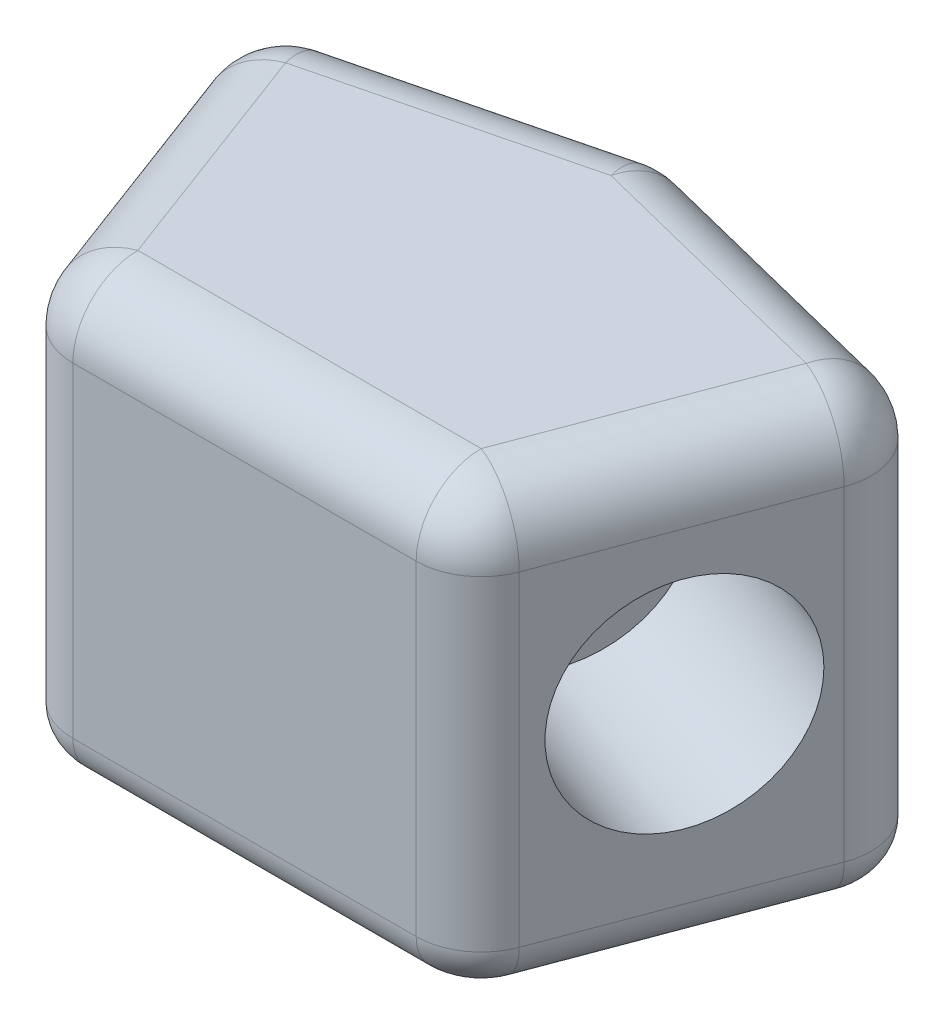
ISO-10303-21;
HEADER;
FILE_DESCRIPTION(('STEP AP214'),'2;1');
FILE_NAME('part.step','',(''),(''),'','','');
FILE_SCHEMA(('AUTOMOTIVE_DESIGN { 1 0 10303 214 1 1 1 1 }'));
ENDSEC;
DATA;
#1=APPLICATION_CONTEXT('core data for automotive mechanical design processes');
#2=APPLICATION_PROTOCOL_DEFINITION('international standard','automotive_design',2000,#1);
#3=PRODUCT_CONTEXT('',#1,'mechanical');
#4=PRODUCT('Part','Part','',(#3));
#5=PRODUCT_RELATED_PRODUCT_CATEGORY('part','',(#4));
#6=PRODUCT_DEFINITION_FORMATION('','',#4);
#7=PRODUCT_DEFINITION_CONTEXT('part definition',#1,'design');
#8=PRODUCT_DEFINITION('design','',#6,#7);
#9=PRODUCT_DEFINITION_SHAPE('','',#8);
#10=(LENGTH_UNIT() NAMED_UNIT(*) SI_UNIT(.MILLI.,.METRE.));
#11=(NAMED_UNIT(*) PLANE_ANGLE_UNIT() SI_UNIT($,.RADIAN.));
#12=(NAMED_UNIT(*) SI_UNIT($,.STERADIAN.) SOLID_ANGLE_UNIT());
#13=UNCERTAINTY_MEASURE_WITH_UNIT(LENGTH_MEASURE(1.E-05),#10,'distance_accuracy_value','');
#14=(GEOMETRIC_REPRESENTATION_CONTEXT(3) GLOBAL_UNCERTAINTY_ASSIGNED_CONTEXT((#13)) GLOBAL_UNIT_ASSIGNED_CONTEXT((#10,
#11,#12)) REPRESENTATION_CONTEXT('',''));
#15=CARTESIAN_POINT('',(0.,0.,0.));
#16=DIRECTION('',(0.,0.,1.));
#17=DIRECTION('',(1.,0.,0.));
#18=AXIS2_PLACEMENT_3D('',#15,#16,#17);
#19=CARTESIAN_POINT('',(-8.,10.,-8.));
#20=DIRECTION('',(0.936329177569045,0.,-0.351123441588392));
#21=DIRECTION('',(-0.351123441588392,0.,-0.936329177569045));
#22=AXIS2_PLACEMENT_3D('',#19,#20,#21);
#23=PLANE('',#22);
#24=CARTESIAN_POINT('',(-6.40449376635357,5.,-3.74531671027618));
#25=DIRECTION('',(-0.936329177569045,0.,0.351123441588392));
#26=DIRECTION('',(0.351123441588392,0.,0.936329177569045));
#27=AXIS2_PLACEMENT_3D('',#24,#25,#26);
#28=CIRCLE('',#27,2.5);
#29=CARTESIAN_POINT('',(-5.52668516238259,5.,-1.40449376635357));
#30=VERTEX_POINT('',#29);
#31=EDGE_CURVE('E773',#30,#30,#28,.T.);
#32=ORIENTED_EDGE('',*,*,#31,.F.);
#33=EDGE_LOOP('',(#32));
#34=FACE_BOUND('',#33,.T.);
#35=DIRECTION('',(0.,-1.,0.));
#36=VECTOR('',#35,1.);
#37=CARTESIAN_POINT('',(-7.40969382957686,10.,-6.42585021220497));
#38=LINE('',#37,#36);
#39=CARTESIAN_POINT('',(-7.40969382957686,8.5,-6.42585021220497));
#40=VERTEX_POINT('',#39);
#41=CARTESIAN_POINT('',(-7.40969382957686,0.999999999999999,-6.42585021220497));
#42=VERTEX_POINT('',#41);
#43=EDGE_CURVE('E342',#40,#42,#38,.T.);
#44=ORIENTED_EDGE('',*,*,#43,.T.);
#45=DIRECTION('',(0.351123441588392,0.,0.936329177569045));
#46=VECTOR('',#45,1.);
#47=CARTESIAN_POINT('',(-5.36499306410653,0.999999999999999,-0.973314837617409));
#48=LINE('',#47,#46);
#49=CARTESIAN_POINT('',(-5.36499306410653,0.999999999999992,-0.973314837617412));
#50=VERTEX_POINT('',#49);
#51=EDGE_CURVE('E279',#42,#50,#48,.T.);
#52=ORIENTED_EDGE('',*,*,#51,.T.);
#53=DIRECTION('',(0.,-1.,0.));
#54=VECTOR('',#53,1.);
#55=CARTESIAN_POINT('',(-5.36499306410653,10.,-0.973314837617412));
#56=LINE('',#55,#54);
#57=CARTESIAN_POINT('',(-5.36499306410653,8.5,-0.973314837617412));
#58=VERTEX_POINT('',#57);
#59=EDGE_CURVE('E335',#50,#58,#56,.F.);
#60=ORIENTED_EDGE('',*,*,#59,.T.);
#61=DIRECTION('',(0.351123441588392,0.,0.936329177569045));
#62=VECTOR('',#61,1.);
#63=CARTESIAN_POINT('',(-8.,8.5,-8.));
#64=LINE('',#63,#62);
#65=EDGE_CURVE('E217',#58,#40,#64,.F.);
#66=ORIENTED_EDGE('',*,*,#65,.T.);
#67=EDGE_LOOP('',(#44,#52,#60,#66));
#68=FACE_BOUND('',#67,.T.);
#69=ADVANCED_FACE('F36',(#34,#68),#23,.F.);
#70=CARTESIAN_POINT('',(-5.,10.,0.));
#71=DIRECTION('',(0.,0.,-1.));
#72=DIRECTION('',(-1.,0.,0.));
#73=AXIS2_PLACEMENT_3D('',#70,#71,#72);
#74=PLANE('',#73);
#75=DIRECTION('',(0.,-1.,0.));
#76=VECTOR('',#75,1.);
#77=CARTESIAN_POINT('',(-3.96049929775296,10.,0.));
#78=LINE('',#77,#76);
#79=CARTESIAN_POINT('',(-3.96049929775296,8.5,0.));
#80=VERTEX_POINT('',#79);
#81=CARTESIAN_POINT('',(-3.96049929775296,0.999999999999999,0.));
#82=VERTEX_POINT('',#81);
#83=EDGE_CURVE('E172',#80,#82,#78,.T.);
#84=ORIENTED_EDGE('',*,*,#83,.T.);
#85=DIRECTION('',(1.,0.,0.));
#86=VECTOR('',#85,1.);
#87=CARTESIAN_POINT('',(3.96049929775296,0.999999999999999,0.));
#88=LINE('',#87,#86);
#89=CARTESIAN_POINT('',(3.96049929775296,0.999999999999999,0.));
#90=VERTEX_POINT('',#89);
#91=EDGE_CURVE('E283',#82,#90,#88,.T.);
#92=ORIENTED_EDGE('',*,*,#91,.T.);
#93=DIRECTION('',(0.,-1.,0.));
#94=VECTOR('',#93,1.);
#95=CARTESIAN_POINT('',(3.96049929775296,10.,0.));
#96=LINE('',#95,#94);
#97=CARTESIAN_POINT('',(3.96049929775296,8.5,0.));
#98=VERTEX_POINT('',#97);
#99=EDGE_CURVE('E345',#90,#98,#96,.F.);
#100=ORIENTED_EDGE('',*,*,#99,.T.);
#101=DIRECTION('',(1.,0.,0.));
#102=VECTOR('',#101,1.);
#103=CARTESIAN_POINT('',(-5.,8.5,0.));
#104=LINE('',#103,#102);
#105=EDGE_CURVE('E212',#98,#80,#104,.F.);
#106=ORIENTED_EDGE('',*,*,#105,.T.);
#107=EDGE_LOOP('',(#84,#92,#100,#106));
#108=FACE_BOUND('',#107,.T.);
#109=ADVANCED_FACE('F351',(#108),#74,.F.);
#110=CARTESIAN_POINT('',(5.,10.,0.));
#111=DIRECTION('',(-0.936329177569045,0.,-0.351123441588392));
#112=DIRECTION('',(-0.351123441588392,0.,0.936329177569045));
#113=AXIS2_PLACEMENT_3D('',#110,#111,#112);
#114=PLANE('',#113);
#115=CARTESIAN_POINT('',(6.40449376635357,5.,-3.74531671027618));
#116=DIRECTION('',(0.936329177569045,0.,0.351123441588391));
#117=DIRECTION('',(0.351123441588392,0.,-0.936329177569045));
#118=AXIS2_PLACEMENT_3D('',#115,#116,#117);
#119=CIRCLE('',#118,2.5);
#120=CARTESIAN_POINT('',(7.28230237032455,5.,-6.08613965419879));
#121=VERTEX_POINT('',#120);
#122=EDGE_CURVE('E766',#121,#121,#119,.T.);
#123=ORIENTED_EDGE('',*,*,#122,.F.);
#124=EDGE_LOOP('',(#123));
#125=FACE_BOUND('',#124,.T.);
#126=DIRECTION('',(0.,-1.,0.));
#127=VECTOR('',#126,1.);
#128=CARTESIAN_POINT('',(5.36499306410653,10.,-0.973314837617413));
#129=LINE('',#128,#127);
#130=CARTESIAN_POINT('',(5.36499306410653,8.5,-0.973314837617413));
#131=VERTEX_POINT('',#130);
#132=CARTESIAN_POINT('',(5.36499306410653,0.999999999999999,-0.973314837617413));
#133=VERTEX_POINT('',#132);
#134=EDGE_CURVE('E171',#131,#133,#129,.T.);
#135=ORIENTED_EDGE('',*,*,#134,.T.);
#136=DIRECTION('',(0.351123441588392,0.,-0.936329177569045));
#137=VECTOR('',#136,1.);
#138=CARTESIAN_POINT('',(7.40969382957686,0.999999999999999,-6.42585021220497));
#139=LINE('',#138,#137);
#140=CARTESIAN_POINT('',(7.40969382957686,0.999999999999999,-6.42585021220497));
#141=VERTEX_POINT('',#140);
#142=EDGE_CURVE('E167',#133,#141,#139,.T.);
#143=ORIENTED_EDGE('',*,*,#142,.T.);
#144=DIRECTION('',(0.,-1.,0.));
#145=VECTOR('',#144,1.);
#146=CARTESIAN_POINT('',(7.40969382957686,10.,-6.42585021220497));
#147=LINE('',#146,#145);
#148=CARTESIAN_POINT('',(7.40969382957686,8.5,-6.42585021220497));
#149=VERTEX_POINT('',#148);
#150=EDGE_CURVE('E159',#141,#149,#147,.F.);
#151=ORIENTED_EDGE('',*,*,#150,.T.);
#152=DIRECTION('',(0.351123441588392,0.,-0.936329177569045));
#153=VECTOR('',#152,1.);
#154=CARTESIAN_POINT('',(5.,8.5,0.));
#155=LINE('',#154,#153);
#156=EDGE_CURVE('E164',#149,#131,#155,.F.);
#157=ORIENTED_EDGE('',*,*,#156,.T.);
#158=EDGE_LOOP('',(#135,#143,#151,#157));
#159=FACE_BOUND('',#158,.T.);
#160=ADVANCED_FACE('F162',(#125,#159),#114,.F.);
#161=CARTESIAN_POINT('',(8.,10.,-8.));
#162=DIRECTION('',(-0.242535625036333,0.,0.970142500145332));
#163=DIRECTION('',(0.970142500145332,0.,0.242535625036333));
#164=AXIS2_PLACEMENT_3D('',#161,#162,#163);
#165=PLANE('',#164);
#166=DIRECTION('',(0.,-1.,0.));
#167=VECTOR('',#166,1.);
#168=CARTESIAN_POINT('',(6.36900350077779,10.,-8.40774912480555));
#169=LINE('',#168,#167);
#170=CARTESIAN_POINT('',(6.36900350077779,8.5,-8.40774912480555));
#171=VERTEX_POINT('',#170);
#172=CARTESIAN_POINT('',(6.36900350077779,0.999999999999999,-8.40774912480555));
#173=VERTEX_POINT('',#172);
#174=EDGE_CURVE('E196',#171,#173,#169,.T.);
#175=ORIENTED_EDGE('',*,*,#174,.T.);
#176=DIRECTION('',(-0.970142500145332,0.,-0.242535625036333));
#177=VECTOR('',#176,1.);
#178=CARTESIAN_POINT('',(0.363803437554493,0.999999999999999,-9.90904914061138));
#179=LINE('',#178,#177);
#180=CARTESIAN_POINT('',(0.363803437554496,0.999999999999999,-9.90904914061138));
#181=VERTEX_POINT('',#180);
#182=EDGE_CURVE('E60',#173,#181,#179,.T.);
#183=ORIENTED_EDGE('',*,*,#182,.T.);
#184=DIRECTION('',(0.,-1.,0.));
#185=VECTOR('',#184,1.);
#186=CARTESIAN_POINT('',(0.363803437554496,10.,-9.90904914061138));
#187=LINE('',#186,#185);
#188=CARTESIAN_POINT('',(0.363803437554496,8.5,-9.90904914061138));
#189=VERTEX_POINT('',#188);
#190=EDGE_CURVE('E332',#181,#189,#187,.F.);
#191=ORIENTED_EDGE('',*,*,#190,.T.);
#192=DIRECTION('',(-0.970142500145332,0.,-0.242535625036333));
#193=VECTOR('',#192,1.);
#194=CARTESIAN_POINT('',(8.,8.5,-8.));
#195=LINE('',#194,#193);
#196=EDGE_CURVE('E227',#189,#171,#195,.F.);
#197=ORIENTED_EDGE('',*,*,#196,.T.);
#198=EDGE_LOOP('',(#175,#183,#191,#197));
#199=FACE_BOUND('',#198,.T.);
#200=ADVANCED_FACE('F330',(#199),#165,.F.);
#201=CARTESIAN_POINT('',(0.,10.,-10.));
#202=DIRECTION('',(0.242535625036333,0.,0.970142500145332));
#203=DIRECTION('',(0.970142500145332,0.,-0.242535625036333));
#204=AXIS2_PLACEMENT_3D('',#201,#202,#203);
#205=PLANE('',#204);
#206=DIRECTION('',(0.,-1.,0.));
#207=VECTOR('',#206,1.);
#208=CARTESIAN_POINT('',(-0.363803437554502,10.,-9.90904914061137));
#209=LINE('',#208,#207);
#210=CARTESIAN_POINT('',(-0.363803437554502,8.5,-9.90904914061137));
#211=VERTEX_POINT('',#210);
#212=CARTESIAN_POINT('',(-0.363803437554502,0.999999999999999,-9.90904914061137));
#213=VERTEX_POINT('',#212);
#214=EDGE_CURVE('E333',#211,#213,#209,.T.);
#215=ORIENTED_EDGE('',*,*,#214,.T.);
#216=DIRECTION('',(-0.970142500145332,0.,0.242535625036333));
#217=VECTOR('',#216,1.);
#218=CARTESIAN_POINT('',(-6.3690035007778,0.999999999999999,-8.40774912480555));
#219=LINE('',#218,#217);
#220=CARTESIAN_POINT('',(-6.36900350077779,0.999999999999999,-8.40774912480555));
#221=VERTEX_POINT('',#220);
#222=EDGE_CURVE('E11',#213,#221,#219,.T.);
#223=ORIENTED_EDGE('',*,*,#222,.T.);
#224=DIRECTION('',(0.,-1.,0.));
#225=VECTOR('',#224,1.);
#226=CARTESIAN_POINT('',(-6.36900350077779,10.,-8.40774912480555));
#227=LINE('',#226,#225);
#228=CARTESIAN_POINT('',(-6.36900350077779,8.5,-8.40774912480555));
#229=VERTEX_POINT('',#228);
#230=EDGE_CURVE('E337',#221,#229,#227,.F.);
#231=ORIENTED_EDGE('',*,*,#230,.T.);
#232=DIRECTION('',(-0.970142500145332,0.,0.242535625036333));
#233=VECTOR('',#232,1.);
#234=CARTESIAN_POINT('',(0.,8.5,-10.));
#235=LINE('',#234,#233);
#236=EDGE_CURVE('E222',#229,#211,#235,.F.);
#237=ORIENTED_EDGE('',*,*,#236,.T.);
#238=EDGE_LOOP('',(#215,#223,#231,#237));
#239=FACE_BOUND('',#238,.T.);
#240=ADVANCED_FACE('F385',(#239),#205,.F.);
#241=CARTESIAN_POINT('',(0.,10.,0.));
#242=DIRECTION('',(0.,-1.,0.));
#243=DIRECTION('',(0.,0.,-1.));
#244=AXIS2_PLACEMENT_3D('',#241,#242,#243);
#245=PLANE('',#244);
#246=DIRECTION('',(1.,0.,0.));
#247=VECTOR('',#246,1.);
#248=CARTESIAN_POINT('',(0.,10.,-1.5));
#249=LINE('',#248,#247);
#250=CARTESIAN_POINT('',(-3.96049929775296,10.,-1.5));
#251=VERTEX_POINT('',#250);
#252=CARTESIAN_POINT('',(3.96049929775296,10.,-1.5));
#253=VERTEX_POINT('',#252);
#254=EDGE_CURVE('E206',#251,#253,#249,.T.);
#255=ORIENTED_EDGE('',*,*,#254,.T.);
#256=DIRECTION('',(0.351123441588392,0.,-0.936329177569045));
#257=VECTOR('',#256,1.);
#258=CARTESIAN_POINT('',(2.97906787748205,10.,1.11715045405577));
#259=LINE('',#258,#257);
#260=CARTESIAN_POINT('',(6.00520006322329,10.,-6.95253537458755));
#261=VERTEX_POINT('',#260);
#262=EDGE_CURVE('E192',#253,#261,#259,.T.);
#263=ORIENTED_EDGE('',*,*,#262,.T.);
#264=DIRECTION('',(-0.970142500145332,0.,-0.242535625036333));
#265=VECTOR('',#264,1.);
#266=CARTESIAN_POINT('',(1.98913773891609,10.,-7.95655095566435));
#267=LINE('',#266,#265);
#268=CARTESIAN_POINT('',(0.,10.,-8.45383539039338));
#269=VERTEX_POINT('',#268);
#270=EDGE_CURVE('E197',#261,#269,#267,.T.);
#271=ORIENTED_EDGE('',*,*,#270,.T.);
#272=DIRECTION('',(-0.970142500145332,0.,0.242535625036333));
#273=VECTOR('',#272,1.);
#274=CARTESIAN_POINT('',(-1.98913773891609,10.,-7.95655095566435));
#275=LINE('',#274,#273);
#276=CARTESIAN_POINT('',(-6.0052000632233,10.,-6.95253537458755));
#277=VERTEX_POINT('',#276);
#278=EDGE_CURVE('E199',#269,#277,#275,.T.);
#279=ORIENTED_EDGE('',*,*,#278,.T.);
#280=DIRECTION('',(0.351123441588392,0.,0.936329177569045));
#281=VECTOR('',#280,1.);
#282=CARTESIAN_POINT('',(-2.97906787748205,10.,1.11715045405577));
#283=LINE('',#282,#281);
#284=EDGE_CURVE('E204',#277,#251,#283,.T.);
#285=ORIENTED_EDGE('',*,*,#284,.T.);
#286=EDGE_LOOP('',(#255,#263,#271,#279,#285));
#287=FACE_BOUND('',#286,.T.);
#288=ADVANCED_FACE('F416',(#287),#245,.F.);
#289=CARTESIAN_POINT('',(0.,0.,0.));
#290=DIRECTION('',(0.,-1.,0.));
#291=DIRECTION('',(0.,0.,-1.));
#292=AXIS2_PLACEMENT_3D('',#289,#290,#291);
#293=PLANE('',#292);
#294=DIRECTION('',(0.351123441588392,0.,0.936329177569045));
#295=VECTOR('',#294,1.);
#296=CARTESIAN_POINT('',(-6.47336465200782,0.,-6.77697365379336));
#297=LINE('',#296,#295);
#298=CARTESIAN_POINT('',(-4.42866388653749,0.,-1.3244382792058));
#299=VERTEX_POINT('',#298);
#300=CARTESIAN_POINT('',(-6.47336465200782,0.,-6.77697365379336));
#301=VERTEX_POINT('',#300);
#302=EDGE_CURVE('E271',#299,#301,#297,.F.);
#303=ORIENTED_EDGE('',*,*,#302,.T.);
#304=CARTESIAN_POINT('',(-6.0052000632233,0.,-6.95253537458755));
#305=DIRECTION('',(0.,-1.,0.));
#306=DIRECTION('',(0.,0.,-1.));
#307=AXIS2_PLACEMENT_3D('',#304,#305,#306);
#308=CIRCLE('',#307,0.5);
#309=CARTESIAN_POINT('',(-6.12646787574146,0.,-7.43760662466022));
#310=VERTEX_POINT('',#309);
#311=EDGE_CURVE('E273',#301,#310,#308,.T.);
#312=ORIENTED_EDGE('',*,*,#311,.T.);
#313=DIRECTION('',(-0.970142500145332,0.,0.242535625036333));
#314=VECTOR('',#313,1.);
#315=CARTESIAN_POINT('',(-0.121267812518169,0.,-8.93890664046604));
#316=LINE('',#315,#314);
#317=CARTESIAN_POINT('',(-0.121267812518169,0.,-8.93890664046604));
#318=VERTEX_POINT('',#317);
#319=EDGE_CURVE('E255',#310,#318,#316,.F.);
#320=ORIENTED_EDGE('',*,*,#319,.T.);
#321=CARTESIAN_POINT('',(0.,0.,-8.45383539039338));
#322=DIRECTION('',(0.,-1.,0.));
#323=DIRECTION('',(0.,0.,-1.));
#324=AXIS2_PLACEMENT_3D('',#321,#322,#323);
#325=CIRCLE('',#324,0.5);
#326=CARTESIAN_POINT('',(0.121267812518163,0.,-8.93890664046604));
#327=VERTEX_POINT('',#326);
#328=EDGE_CURVE('E257',#318,#327,#325,.T.);
#329=ORIENTED_EDGE('',*,*,#328,.T.);
#330=DIRECTION('',(-0.970142500145332,0.,-0.242535625036333));
#331=VECTOR('',#330,1.);
#332=CARTESIAN_POINT('',(6.12646787574146,0.,-7.43760662466022));
#333=LINE('',#332,#331);
#334=CARTESIAN_POINT('',(6.12646787574146,0.,-7.43760662466022));
#335=VERTEX_POINT('',#334);
#336=EDGE_CURVE('E259',#327,#335,#333,.F.);
#337=ORIENTED_EDGE('',*,*,#336,.T.);
#338=CARTESIAN_POINT('',(6.00520006322329,0.,-6.95253537458755));
#339=DIRECTION('',(0.,-1.,0.));
#340=DIRECTION('',(0.,0.,-1.));
#341=AXIS2_PLACEMENT_3D('',#338,#339,#340);
#342=CIRCLE('',#341,0.5);
#343=CARTESIAN_POINT('',(6.47336465200782,0.,-6.77697365379336));
#344=VERTEX_POINT('',#343);
#345=EDGE_CURVE('E261',#335,#344,#342,.T.);
#346=ORIENTED_EDGE('',*,*,#345,.T.);
#347=DIRECTION('',(0.351123441588392,0.,-0.936329177569045));
#348=VECTOR('',#347,1.);
#349=CARTESIAN_POINT('',(4.42866388653748,0.,-1.3244382792058));
#350=LINE('',#349,#348);
#351=CARTESIAN_POINT('',(4.42866388653748,0.,-1.3244382792058));
#352=VERTEX_POINT('',#351);
#353=EDGE_CURVE('E263',#344,#352,#350,.F.);
#354=ORIENTED_EDGE('',*,*,#353,.T.);
#355=CARTESIAN_POINT('',(3.96049929775296,0.,-1.5));
#356=DIRECTION('',(0.,-1.,0.));
#357=DIRECTION('',(0.,0.,-1.));
#358=AXIS2_PLACEMENT_3D('',#355,#356,#357);
#359=CIRCLE('',#358,0.5);
#360=CARTESIAN_POINT('',(3.96049929775296,0.,-1.));
#361=VERTEX_POINT('',#360);
#362=EDGE_CURVE('E265',#352,#361,#359,.T.);
#363=ORIENTED_EDGE('',*,*,#362,.T.);
#364=DIRECTION('',(1.,0.,0.));
#365=VECTOR('',#364,1.);
#366=CARTESIAN_POINT('',(-3.96049929775296,0.,-1.));
#367=LINE('',#366,#365);
#368=CARTESIAN_POINT('',(-3.96049929775296,0.,-1.));
#369=VERTEX_POINT('',#368);
#370=EDGE_CURVE('E267',#361,#369,#367,.F.);
#371=ORIENTED_EDGE('',*,*,#370,.T.);
#372=CARTESIAN_POINT('',(-3.96049929775296,0.,-1.5));
#373=DIRECTION('',(0.,-1.,0.));
#374=DIRECTION('',(0.,0.,-1.));
#375=AXIS2_PLACEMENT_3D('',#372,#373,#374);
#376=CIRCLE('',#375,0.5);
#377=EDGE_CURVE('E269',#369,#299,#376,.T.);
#378=ORIENTED_EDGE('',*,*,#377,.T.);
#379=EDGE_LOOP('',(#303,#312,#320,#329,#337,#346,#354,#363,#371,#378));
#380=FACE_BOUND('',#379,.T.);
#381=CARTESIAN_POINT('',(0.,0.,-5.));
#382=DIRECTION('',(0.,-1.,0.));
#383=DIRECTION('',(0.,0.,-1.));
#384=AXIS2_PLACEMENT_3D('',#381,#382,#383);
#385=CIRCLE('',#384,2.5);
#386=CARTESIAN_POINT('',(0.,0.,-7.5));
#387=VERTEX_POINT('',#386);
#388=EDGE_CURVE('E229',#387,#387,#385,.F.);
#389=ORIENTED_EDGE('',*,*,#388,.T.);
#390=EDGE_LOOP('',(#389));
#391=FACE_BOUND('',#390,.T.);
#392=ADVANCED_FACE('F367',(#380,#391),#293,.T.);
#393=CARTESIAN_POINT('',(1.72284787850835,5.,-5.50093391821814));
#394=DIRECTION('',(0.936329177569045,0.,0.351123441588391));
#395=DIRECTION('',(0.351123441588392,0.,-0.936329177569045));
#396=AXIS2_PLACEMENT_3D('',#393,#394,#395);
#397=CYLINDRICAL_SURFACE('',#396,2.5);
#398=CARTESIAN_POINT('',(1.72284787850835,5.,-5.50093391821814));
#399=DIRECTION('',(0.936329177569045,0.,0.351123441588391));
#400=DIRECTION('',(0.351123441588392,0.,-0.936329177569045));
#401=AXIS2_PLACEMENT_3D('',#398,#399,#400);
#402=CIRCLE('',#401,2.5);
#403=CARTESIAN_POINT('',(2.60065648247932,5.,-7.84175686214075));
#404=VERTEX_POINT('',#403);
#405=EDGE_CURVE('E392',#404,#404,#402,.T.);
#406=CARTESIAN_POINT('',(2.60065648247932,5.,-7.84175686214075));
#407=CARTESIAN_POINT('',(2.64942362714438,5.,-7.82346918289135));
#408=CARTESIAN_POINT('',(2.69819077180943,5.,-7.80518150364196));
#409=CARTESIAN_POINT('',(2.79572506113954,5.,-7.76860614514317));
#410=CARTESIAN_POINT('',(2.8444922058046,5.,-7.75031846589377));
#411=CARTESIAN_POINT('',(2.94202649513471,5.,-7.71374310739498));
#412=CARTESIAN_POINT('',(2.99079363979976,5.,-7.69545542814558));
#413=CARTESIAN_POINT('',(3.08832792912987,5.,-7.65888006964679));
#414=CARTESIAN_POINT('',(3.13709507379492,5.,-7.6405923903974));
#415=CARTESIAN_POINT('',(3.23462936312503,5.,-7.60401703189861));
#416=CARTESIAN_POINT('',(3.28339650779009,5.,-7.58572935264921));
#417=CARTESIAN_POINT('',(3.38093079712019,5.,-7.54915399415042));
#418=CARTESIAN_POINT('',(3.42969794178525,5.,-7.53086631490103));
#419=CARTESIAN_POINT('',(3.52723223111536,5.,-7.49429095640224));
#420=CARTESIAN_POINT('',(3.57599937578041,5.,-7.47600327715284));
#421=CARTESIAN_POINT('',(3.67353366511052,5.,-7.43942791865405));
#422=CARTESIAN_POINT('',(3.72230080977558,5.,-7.42114023940465));
#423=CARTESIAN_POINT('',(3.81983509910568,5.,-7.38456488090586));
#424=CARTESIAN_POINT('',(3.86860224377074,5.,-7.36627720165647));
#425=CARTESIAN_POINT('',(3.96613653310085,5.,-7.32970184315768));
#426=CARTESIAN_POINT('',(4.0149036777659,5.,-7.31141416390828));
#427=CARTESIAN_POINT('',(4.11243796709601,5.,-7.27483880540949));
#428=CARTESIAN_POINT('',(4.16120511176107,5.,-7.25655112616009));
#429=CARTESIAN_POINT('',(4.25873940109117,5.,-7.2199757676613));
#430=CARTESIAN_POINT('',(4.30750654575623,5.,-7.20168808841191));
#431=CARTESIAN_POINT('',(4.40504083508634,5.,-7.16511272991312));
#432=CARTESIAN_POINT('',(4.45380797975139,5.,-7.14682505066372));
#433=CARTESIAN_POINT('',(4.5513422690815,5.,-7.11024969216493));
#434=CARTESIAN_POINT('',(4.60010941374656,5.,-7.09196201291554));
#435=CARTESIAN_POINT('',(4.69764370307666,5.,-7.05538665441675));
#436=CARTESIAN_POINT('',(4.74641084774172,5.,-7.03709897516735));
#437=CARTESIAN_POINT('',(4.84394513707183,5.,-7.00052361666856));
#438=CARTESIAN_POINT('',(4.89271228173688,5.,-6.98223593741916));
#439=CARTESIAN_POINT('',(4.99024657106699,5.,-6.94566057892037));
#440=CARTESIAN_POINT('',(5.03901371573204,5.,-6.92737289967098));
#441=CARTESIAN_POINT('',(5.13654800506215,5.,-6.89079754117219));
#442=CARTESIAN_POINT('',(5.18531514972721,5.,-6.87250986192279));
#443=CARTESIAN_POINT('',(5.28284943905732,5.,-6.835934503424));
#444=CARTESIAN_POINT('',(5.33161658372237,5.,-6.81764682417461));
#445=CARTESIAN_POINT('',(5.42915087305248,5.,-6.78107146567582));
#446=CARTESIAN_POINT('',(5.47791801771753,5.,-6.76278378642642));
#447=CARTESIAN_POINT('',(5.57545230704764,5.,-6.72620842792763));
#448=CARTESIAN_POINT('',(5.6242194517127,5.,-6.70792074867823));
#449=CARTESIAN_POINT('',(5.72175374104281,5.,-6.67134539017944));
#450=CARTESIAN_POINT('',(5.77052088570786,5.,-6.65305771093005));
#451=CARTESIAN_POINT('',(5.86805517503797,5.,-6.61648235243126));
#452=CARTESIAN_POINT('',(5.91682231970302,5.,-6.59819467318186));
#453=CARTESIAN_POINT('',(6.01435660903313,5.,-6.56161931468307));
#454=CARTESIAN_POINT('',(6.06312375369819,5.,-6.54333163543367));
#455=CARTESIAN_POINT('',(6.1606580430283,5.,-6.50675627693489));
#456=CARTESIAN_POINT('',(6.20942518769335,5.,-6.48846859768549));
#457=CARTESIAN_POINT('',(6.30695947702346,5.,-6.4518932391867));
#458=CARTESIAN_POINT('',(6.35572662168851,5.,-6.4336055599373));
#459=CARTESIAN_POINT('',(6.45326091101862,5.,-6.39703020143851));
#460=CARTESIAN_POINT('',(6.50202805568368,5.,-6.37874252218912));
#461=CARTESIAN_POINT('',(6.59956234501379,5.,-6.34216716369033));
#462=CARTESIAN_POINT('',(6.64832948967884,5.,-6.32387948444093));
#463=CARTESIAN_POINT('',(6.74586377900895,5.,-6.28730412594214));
#464=CARTESIAN_POINT('',(6.794630923674,5.,-6.26901644669274));
#465=CARTESIAN_POINT('',(6.89216521300411,5.,-6.23244108819395));
#466=CARTESIAN_POINT('',(6.94093235766917,5.,-6.21415340894456));
#467=CARTESIAN_POINT('',(7.03846664699928,5.,-6.17757805044577));
#468=CARTESIAN_POINT('',(7.08723379166433,5.,-6.15929037119637));
#469=CARTESIAN_POINT('',(7.18476808099444,5.,-6.12271501269758));
#470=CARTESIAN_POINT('',(7.23353522565949,5.,-6.10442733344819));
#471=CARTESIAN_POINT('',(7.28230237032455,5.,-6.08613965419879));
#472=B_SPLINE_CURVE_WITH_KNOTS('',3,(#406,#407,#408,#409,#410,#411,#412,#413,#414,#415,#416,
#417,#418,#419,#420,#421,#422,#423,#424,#425,#426,#427,#428,#429,#430,#431,#432,#433,#434,#435,
#436,#437,#438,#439,#440,#441,#442,#443,#444,#445,#446,#447,#448,#449,#450,#451,#452,#453,#454,
#455,#456,#457,#458,#459,#460,#461,#462,#463,#464,#465,#466,#467,#468,#469,#470,#471),
.UNSPECIFIED.,.F.,.F.,(4,2,2,2,2,2,2,2,2,2,2,2,2,2,2,2,2,2,2,2,2,2,2,2,2,2,2,2,2,2,2,2,4),(0.,
0.15625,0.3125,0.46875,0.625,0.78125,0.9375,1.09375,1.25,1.40625,1.5625,1.71875,1.875,2.03125,
2.1875,2.34375,2.5,2.65625,2.8125,2.96875,3.125,3.28125,3.4375,3.59375,3.75,3.90625,4.0625,
4.21875,4.375,4.53125,4.6875,4.84375,5.),.UNSPECIFIED.);
#473=EDGE_CURVE('BSEAM696',#404,#121,#472,.T.);
#474=ORIENTED_EDGE('',*,*,#405,.F.);
#475=ORIENTED_EDGE('',*,*,#122,.T.);
#476=ORIENTED_EDGE('',*,*,#473,.T.);
#477=ORIENTED_EDGE('',*,*,#473,.F.);
#478=EDGE_LOOP('',(#474,#476,#475,#477));
#479=FACE_BOUND('',#478,.T.);
#480=ADVANCED_FACE('F696',(#479),#397,.F.);
#481=CARTESIAN_POINT('',(1.72284787850835,5.,-5.50093391821814));
#482=DIRECTION('',(0.936329177569045,0.,0.351123441588391));
#483=DIRECTION('',(0.351123441588392,0.,-0.936329177569045));
#484=AXIS2_PLACEMENT_3D('',#481,#482,#483);
#485=PLANE('',#484);
#486=ORIENTED_EDGE('',*,*,#405,.T.);
#487=EDGE_LOOP('',(#486));
#488=FACE_BOUND('',#487,.T.);
#489=ADVANCED_FACE('F687',(#488),#485,.T.);
#490=CARTESIAN_POINT('',(-1.72284787850835,5.,-5.50093391821814));
#491=DIRECTION('',(-0.936329177569045,0.,0.351123441588392));
#492=DIRECTION('',(0.351123441588392,0.,0.936329177569045));
#493=AXIS2_PLACEMENT_3D('',#490,#491,#492);
#494=CYLINDRICAL_SURFACE('',#493,2.5);
#495=CARTESIAN_POINT('',(-1.72284787850835,5.,-5.50093391821814));
#496=DIRECTION('',(-0.936329177569045,0.,0.351123441588392));
#497=DIRECTION('',(0.351123441588392,0.,0.936329177569045));
#498=AXIS2_PLACEMENT_3D('',#495,#496,#497);
#499=CIRCLE('',#498,2.5);
#500=CARTESIAN_POINT('',(-0.845039274537367,5.,-3.16011097429553));
#501=VERTEX_POINT('',#500);
#502=EDGE_CURVE('E768',#501,#501,#499,.T.);
#503=ORIENTED_EDGE('',*,*,#502,.F.);
#504=EDGE_LOOP('',(#503));
#505=FACE_BOUND('',#504,.T.);
#506=ORIENTED_EDGE('',*,*,#31,.T.);
#507=EDGE_LOOP('',(#506));
#508=FACE_BOUND('',#507,.T.);
#509=ADVANCED_FACE('F678',(#505,#508),#494,.F.);
#510=CARTESIAN_POINT('',(-1.72284787850835,5.,-5.50093391821814));
#511=DIRECTION('',(-0.936329177569045,0.,0.351123441588392));
#512=DIRECTION('',(0.351123441588392,0.,0.936329177569045));
#513=AXIS2_PLACEMENT_3D('',#510,#511,#512);
#514=PLANE('',#513);
#515=ORIENTED_EDGE('',*,*,#502,.T.);
#516=EDGE_LOOP('',(#515));
#517=FACE_BOUND('',#516,.T.);
#518=ADVANCED_FACE('F669',(#517),#514,.T.);
#519=CARTESIAN_POINT('',(0.,1.,-5.));
#520=DIRECTION('',(0.,-1.,0.));
#521=DIRECTION('',(0.,0.,-1.));
#522=AXIS2_PLACEMENT_3D('',#519,#520,#521);
#523=PLANE('',#522);
#524=CARTESIAN_POINT('',(0.,1.,-5.));
#525=DIRECTION('',(0.,-1.,0.));
#526=DIRECTION('',(0.,0.,-1.));
#527=AXIS2_PLACEMENT_3D('',#524,#525,#526);
#528=CIRCLE('',#527,1.5);
#529=CARTESIAN_POINT('',(0.,1.,-6.5));
#530=VERTEX_POINT('',#529);
#531=EDGE_CURVE('E252',#530,#530,#528,.T.);
#532=ORIENTED_EDGE('',*,*,#531,.T.);
#533=EDGE_LOOP('',(#532));
#534=FACE_BOUND('',#533,.T.);
#535=ADVANCED_FACE('F451',(#534),#523,.T.);
#536=CARTESIAN_POINT('',(0.,10.,-8.45383539039338));
#537=DIRECTION('',(0.,-1.,0.));
#538=DIRECTION('',(0.,0.,-1.));
#539=AXIS2_PLACEMENT_3D('',#536,#537,#538);
#540=CYLINDRICAL_SURFACE('',#539,1.5);
#541=ORIENTED_EDGE('',*,*,#190,.F.);
#542=CARTESIAN_POINT('',(0.,0.999999999999999,-8.45383539039338));
#543=DIRECTION('',(0.,-1.,0.));
#544=DIRECTION('',(0.,0.,-1.));
#545=AXIS2_PLACEMENT_3D('',#542,#543,#544);
#546=CIRCLE('',#545,1.5);
#547=EDGE_CURVE('E45',#181,#213,#546,.F.);
#548=ORIENTED_EDGE('',*,*,#547,.T.);
#549=ORIENTED_EDGE('',*,*,#214,.F.);
#550=CARTESIAN_POINT('',(0.,8.5,-8.45383539039338));
#551=DIRECTION('',(0.,-1.,0.));
#552=DIRECTION('',(0.,0.,-1.));
#553=AXIS2_PLACEMENT_3D('',#550,#551,#552);
#554=CIRCLE('',#553,1.5);
#555=EDGE_CURVE('E224',#211,#189,#554,.T.);
#556=ORIENTED_EDGE('',*,*,#555,.T.);
#557=EDGE_LOOP('',(#541,#548,#549,#556));
#558=FACE_BOUND('',#557,.T.);
#559=ADVANCED_FACE('F425',(#558),#540,.T.);
#560=CARTESIAN_POINT('',(-6.0052000632233,10.,-6.95253537458755));
#561=DIRECTION('',(0.,-1.,0.));
#562=DIRECTION('',(0.,0.,-1.));
#563=AXIS2_PLACEMENT_3D('',#560,#561,#562);
#564=CYLINDRICAL_SURFACE('',#563,1.5);
#565=ORIENTED_EDGE('',*,*,#230,.F.);
#566=CARTESIAN_POINT('',(-6.0052000632233,0.999999999999999,-6.95253537458755));
#567=DIRECTION('',(0.,-1.,0.));
#568=DIRECTION('',(0.,0.,-1.));
#569=AXIS2_PLACEMENT_3D('',#566,#567,#568);
#570=CIRCLE('',#569,1.5);
#571=EDGE_CURVE('E276',#221,#42,#570,.F.);
#572=ORIENTED_EDGE('',*,*,#571,.T.);
#573=ORIENTED_EDGE('',*,*,#43,.F.);
#574=CARTESIAN_POINT('',(-6.0052000632233,8.5,-6.95253537458755));
#575=DIRECTION('',(0.,-1.,0.));
#576=DIRECTION('',(0.,0.,-1.));
#577=AXIS2_PLACEMENT_3D('',#574,#575,#576);
#578=CIRCLE('',#577,1.5);
#579=EDGE_CURVE('E219',#40,#229,#578,.T.);
#580=ORIENTED_EDGE('',*,*,#579,.T.);
#581=EDGE_LOOP('',(#565,#572,#573,#580));
#582=FACE_BOUND('',#581,.T.);
#583=ADVANCED_FACE('F388',(#582),#564,.T.);
#584=CARTESIAN_POINT('',(-3.96049929775296,10.,-1.5));
#585=DIRECTION('',(0.,-1.,0.));
#586=DIRECTION('',(0.,0.,-1.));
#587=AXIS2_PLACEMENT_3D('',#584,#585,#586);
#588=CYLINDRICAL_SURFACE('',#587,1.5);
#589=ORIENTED_EDGE('',*,*,#59,.F.);
#590=CARTESIAN_POINT('',(-3.96049929775296,0.999999999999992,-1.5));
#591=DIRECTION('',(0.,-1.,0.));
#592=DIRECTION('',(0.,0.,-1.));
#593=AXIS2_PLACEMENT_3D('',#590,#591,#592);
#594=CIRCLE('',#593,1.5);
#595=EDGE_CURVE('E281',#50,#82,#594,.F.);
#596=ORIENTED_EDGE('',*,*,#595,.T.);
#597=ORIENTED_EDGE('',*,*,#83,.F.);
#598=CARTESIAN_POINT('',(-3.96049929775296,8.5,-1.5));
#599=DIRECTION('',(0.,-1.,0.));
#600=DIRECTION('',(0.,0.,-1.));
#601=AXIS2_PLACEMENT_3D('',#598,#599,#600);
#602=CIRCLE('',#601,1.5);
#603=EDGE_CURVE('E214',#80,#58,#602,.T.);
#604=ORIENTED_EDGE('',*,*,#603,.T.);
#605=EDGE_LOOP('',(#589,#596,#597,#604));
#606=FACE_BOUND('',#605,.T.);
#607=ADVANCED_FACE('F401',(#606),#588,.T.);
#608=CARTESIAN_POINT('',(3.96049929775296,10.,-1.5));
#609=DIRECTION('',(0.,-1.,0.));
#610=DIRECTION('',(0.,0.,-1.));
#611=AXIS2_PLACEMENT_3D('',#608,#609,#610);
#612=CYLINDRICAL_SURFACE('',#611,1.5);
#613=ORIENTED_EDGE('',*,*,#99,.F.);
#614=CARTESIAN_POINT('',(3.96049929775296,0.999999999999999,-1.5));
#615=DIRECTION('',(0.,-1.,0.));
#616=DIRECTION('',(0.,0.,-1.));
#617=AXIS2_PLACEMENT_3D('',#614,#615,#616);
#618=CIRCLE('',#617,1.5);
#619=EDGE_CURVE('E285',#90,#133,#618,.F.);
#620=ORIENTED_EDGE('',*,*,#619,.T.);
#621=ORIENTED_EDGE('',*,*,#134,.F.);
#622=CARTESIAN_POINT('',(3.96049929775296,8.5,-1.5));
#623=DIRECTION('',(0.,-1.,0.));
#624=DIRECTION('',(0.,0.,-1.));
#625=AXIS2_PLACEMENT_3D('',#622,#623,#624);
#626=CIRCLE('',#625,1.5);
#627=EDGE_CURVE('E191',#131,#98,#626,.T.);
#628=ORIENTED_EDGE('',*,*,#627,.T.);
#629=EDGE_LOOP('',(#613,#620,#621,#628));
#630=FACE_BOUND('',#629,.T.);
#631=ADVANCED_FACE('F456',(#630),#612,.T.);
#632=CARTESIAN_POINT('',(6.00520006322329,10.,-6.95253537458755));
#633=DIRECTION('',(0.,-1.,0.));
#634=DIRECTION('',(0.,0.,-1.));
#635=AXIS2_PLACEMENT_3D('',#632,#633,#634);
#636=CYLINDRICAL_SURFACE('',#635,1.5);
#637=ORIENTED_EDGE('',*,*,#150,.F.);
#638=CARTESIAN_POINT('',(6.00520006322329,0.999999999999999,-6.95253537458755));
#639=DIRECTION('',(0.,-1.,0.));
#640=DIRECTION('',(0.,0.,-1.));
#641=AXIS2_PLACEMENT_3D('',#638,#639,#640);
#642=CIRCLE('',#641,1.5);
#643=EDGE_CURVE('E288',#141,#173,#642,.F.);
#644=ORIENTED_EDGE('',*,*,#643,.T.);
#645=ORIENTED_EDGE('',*,*,#174,.F.);
#646=CARTESIAN_POINT('',(6.00520006322329,8.5,-6.95253537458755));
#647=DIRECTION('',(0.,-1.,0.));
#648=DIRECTION('',(0.,0.,-1.));
#649=AXIS2_PLACEMENT_3D('',#646,#647,#648);
#650=CIRCLE('',#649,1.5);
#651=EDGE_CURVE('E179',#171,#149,#650,.T.);
#652=ORIENTED_EDGE('',*,*,#651,.T.);
#653=EDGE_LOOP('',(#637,#644,#645,#652));
#654=FACE_BOUND('',#653,.T.);
#655=ADVANCED_FACE('F195',(#654),#636,.T.);
#656=CARTESIAN_POINT('',(-2.97906787748205,8.5,1.11715045405577));
#657=DIRECTION('',(0.351123441588392,0.,0.936329177569045));
#658=DIRECTION('',(0.936329177569045,0.,-0.351123441588392));
#659=AXIS2_PLACEMENT_3D('',#656,#657,#658);
#660=CYLINDRICAL_SURFACE('',#659,1.5);
#661=CARTESIAN_POINT('',(-6.0052000632233,8.5,-6.95253537458755));
#662=DIRECTION('',(-0.351123441588392,0.,-0.936329177569044));
#663=DIRECTION('',(-0.936329177569045,0.,0.351123441588392));
#664=AXIS2_PLACEMENT_3D('',#661,#662,#663);
#665=CIRCLE('',#664,1.5);
#666=EDGE_CURVE('E246',#40,#277,#665,.T.);
#667=ORIENTED_EDGE('',*,*,#666,.F.);
#668=ORIENTED_EDGE('',*,*,#65,.F.);
#669=CARTESIAN_POINT('',(-3.96049929775296,8.5,-1.5));
#670=DIRECTION('',(0.351123441588392,0.,0.936329177569045));
#671=DIRECTION('',(0.936329177569045,0.,-0.351123441588392));
#672=AXIS2_PLACEMENT_3D('',#669,#670,#671);
#673=CIRCLE('',#672,1.5);
#674=EDGE_CURVE('E249',#251,#58,#673,.T.);
#675=ORIENTED_EDGE('',*,*,#674,.F.);
#676=ORIENTED_EDGE('',*,*,#284,.F.);
#677=EDGE_LOOP('',(#667,#668,#675,#676));
#678=FACE_BOUND('',#677,.T.);
#679=ADVANCED_FACE('F408',(#678),#660,.T.);
#680=CARTESIAN_POINT('',(-3.96049929775296,8.5,-1.5));
#681=DIRECTION('',(0.,-1.,0.));
#682=DIRECTION('',(0.,0.,-1.));
#683=AXIS2_PLACEMENT_3D('',#680,#681,#682);
#684=SPHERICAL_SURFACE('',#683,1.5);
#685=ORIENTED_EDGE('',*,*,#674,.T.);
#686=ORIENTED_EDGE('',*,*,#603,.F.);
#687=CARTESIAN_POINT('',(-3.96049929775296,8.5,-1.5));
#688=DIRECTION('',(1.,0.,0.));
#689=DIRECTION('',(0.,0.,-1.));
#690=AXIS2_PLACEMENT_3D('',#687,#688,#689);
#691=CIRCLE('',#690,1.5);
#692=EDGE_CURVE('E243',#251,#80,#691,.T.);
#693=ORIENTED_EDGE('',*,*,#692,.F.);
#694=EDGE_LOOP('',(#685,#686,#693));
#695=FACE_BOUND('',#694,.T.);
#696=ADVANCED_FACE('F410',(#695),#684,.T.);
#697=CARTESIAN_POINT('',(-6.0052000632233,8.5,-6.95253537458755));
#698=DIRECTION('',(0.,-1.,0.));
#699=DIRECTION('',(0.,0.,-1.));
#700=AXIS2_PLACEMENT_3D('',#697,#698,#699);
#701=SPHERICAL_SURFACE('',#700,1.5);
#702=ORIENTED_EDGE('',*,*,#579,.F.);
#703=ORIENTED_EDGE('',*,*,#666,.T.);
#704=CARTESIAN_POINT('',(-6.0052000632233,8.5,-6.95253537458755));
#705=DIRECTION('',(0.970142500145332,0.,-0.242535625036332));
#706=DIRECTION('',(-0.242535625036332,0.,-0.970142500145332));
#707=AXIS2_PLACEMENT_3D('',#704,#705,#706);
#708=CIRCLE('',#707,1.5);
#709=EDGE_CURVE('E240',#229,#277,#708,.T.);
#710=ORIENTED_EDGE('',*,*,#709,.F.);
#711=EDGE_LOOP('',(#702,#703,#710));
#712=FACE_BOUND('',#711,.T.);
#713=ADVANCED_FACE('F419',(#712),#701,.T.);
#714=CARTESIAN_POINT('',(0.,8.5,-1.5));
#715=DIRECTION('',(1.,0.,0.));
#716=DIRECTION('',(0.,0.,-1.));
#717=AXIS2_PLACEMENT_3D('',#714,#715,#716);
#718=CYLINDRICAL_SURFACE('',#717,1.5);
#719=ORIENTED_EDGE('',*,*,#692,.T.);
#720=ORIENTED_EDGE('',*,*,#105,.F.);
#721=CARTESIAN_POINT('',(3.96049929775296,8.5,-1.5));
#722=DIRECTION('',(1.,0.,0.));
#723=DIRECTION('',(0.,0.,-1.));
#724=AXIS2_PLACEMENT_3D('',#721,#722,#723);
#725=CIRCLE('',#724,1.5);
#726=EDGE_CURVE('E237',#253,#98,#725,.T.);
#727=ORIENTED_EDGE('',*,*,#726,.F.);
#728=ORIENTED_EDGE('',*,*,#254,.F.);
#729=EDGE_LOOP('',(#719,#720,#727,#728));
#730=FACE_BOUND('',#729,.T.);
#731=ADVANCED_FACE('F414',(#730),#718,.T.);
#732=CARTESIAN_POINT('',(-1.98913773891609,8.5,-7.95655095566435));
#733=DIRECTION('',(-0.970142500145332,0.,0.242535625036333));
#734=DIRECTION('',(0.242535625036333,0.,0.970142500145332));
#735=AXIS2_PLACEMENT_3D('',#732,#733,#734);
#736=CYLINDRICAL_SURFACE('',#735,1.5);
#737=ORIENTED_EDGE('',*,*,#709,.T.);
#738=ORIENTED_EDGE('',*,*,#278,.F.);
#739=CARTESIAN_POINT('',(0.,8.5,-8.45383539039338));
#740=DIRECTION('',(0.970142500145332,0.,-0.242535625036333));
#741=DIRECTION('',(-0.242535625036333,0.,-0.970142500145332));
#742=AXIS2_PLACEMENT_3D('',#739,#740,#741);
#743=CIRCLE('',#742,1.5);
#744=EDGE_CURVE('E234',#211,#269,#743,.T.);
#745=ORIENTED_EDGE('',*,*,#744,.F.);
#746=ORIENTED_EDGE('',*,*,#236,.F.);
#747=EDGE_LOOP('',(#737,#738,#745,#746));
#748=FACE_BOUND('',#747,.T.);
#749=ADVANCED_FACE('F422',(#748),#736,.T.);
#750=CARTESIAN_POINT('',(3.96049929775296,8.5,-1.5));
#751=DIRECTION('',(0.,-1.,0.));
#752=DIRECTION('',(0.,0.,-1.));
#753=AXIS2_PLACEMENT_3D('',#750,#751,#752);
#754=SPHERICAL_SURFACE('',#753,1.5);
#755=ORIENTED_EDGE('',*,*,#726,.T.);
#756=ORIENTED_EDGE('',*,*,#627,.F.);
#757=CARTESIAN_POINT('',(3.96049929775296,8.5,-1.5));
#758=DIRECTION('',(0.351123441588392,0.,-0.936329177569045));
#759=DIRECTION('',(-0.936329177569045,0.,-0.351123441588392));
#760=AXIS2_PLACEMENT_3D('',#757,#758,#759);
#761=CIRCLE('',#760,1.5);
#762=EDGE_CURVE('E190',#253,#131,#761,.T.);
#763=ORIENTED_EDGE('',*,*,#762,.F.);
#764=EDGE_LOOP('',(#755,#756,#763));
#765=FACE_BOUND('',#764,.T.);
#766=ADVANCED_FACE('F592',(#765),#754,.T.);
#767=CARTESIAN_POINT('',(0.,8.5,-8.45383539039338));
#768=DIRECTION('',(0.,-1.,0.));
#769=DIRECTION('',(0.,0.,-1.));
#770=AXIS2_PLACEMENT_3D('',#767,#768,#769);
#771=SPHERICAL_SURFACE('',#770,1.5);
#772=ORIENTED_EDGE('',*,*,#555,.F.);
#773=ORIENTED_EDGE('',*,*,#744,.T.);
#774=CARTESIAN_POINT('',(0.,8.5,-8.45383539039338));
#775=DIRECTION('',(0.970142500145332,0.,0.242535625036333));
#776=DIRECTION('',(0.242535625036333,0.,-0.970142500145332));
#777=AXIS2_PLACEMENT_3D('',#774,#775,#776);
#778=CIRCLE('',#777,1.5);
#779=EDGE_CURVE('E185',#189,#269,#778,.T.);
#780=ORIENTED_EDGE('',*,*,#779,.F.);
#781=EDGE_LOOP('',(#772,#773,#780));
#782=FACE_BOUND('',#781,.T.);
#783=ADVANCED_FACE('F428',(#782),#771,.T.);
#784=CARTESIAN_POINT('',(2.97906787748205,8.5,1.11715045405577));
#785=DIRECTION('',(0.351123441588392,0.,-0.936329177569045));
#786=DIRECTION('',(-0.936329177569045,0.,-0.351123441588392));
#787=AXIS2_PLACEMENT_3D('',#784,#785,#786);
#788=CYLINDRICAL_SURFACE('',#787,1.5);
#789=ORIENTED_EDGE('',*,*,#762,.T.);
#790=ORIENTED_EDGE('',*,*,#156,.F.);
#791=CARTESIAN_POINT('',(6.00520006322329,8.5,-6.95253537458755));
#792=DIRECTION('',(0.351123441588392,0.,-0.936329177569045));
#793=DIRECTION('',(-0.936329177569044,0.,-0.351123441588392));
#794=AXIS2_PLACEMENT_3D('',#791,#792,#793);
#795=CIRCLE('',#794,1.5);
#796=EDGE_CURVE('E177',#261,#149,#795,.T.);
#797=ORIENTED_EDGE('',*,*,#796,.F.);
#798=ORIENTED_EDGE('',*,*,#262,.F.);
#799=EDGE_LOOP('',(#789,#790,#797,#798));
#800=FACE_BOUND('',#799,.T.);
#801=ADVANCED_FACE('F188',(#800),#788,.T.);
#802=CARTESIAN_POINT('',(1.98913773891609,8.5,-7.95655095566435));
#803=DIRECTION('',(-0.970142500145332,0.,-0.242535625036333));
#804=DIRECTION('',(-0.242535625036333,0.,0.970142500145332));
#805=AXIS2_PLACEMENT_3D('',#802,#803,#804);
#806=CYLINDRICAL_SURFACE('',#805,1.5);
#807=ORIENTED_EDGE('',*,*,#779,.T.);
#808=ORIENTED_EDGE('',*,*,#270,.F.);
#809=CARTESIAN_POINT('',(6.00520006322329,8.5,-6.95253537458755));
#810=DIRECTION('',(0.970142500145332,0.,0.242535625036333));
#811=DIRECTION('',(0.242535625036333,0.,-0.970142500145332));
#812=AXIS2_PLACEMENT_3D('',#809,#810,#811);
#813=CIRCLE('',#812,1.5);
#814=EDGE_CURVE('E181',#171,#261,#813,.T.);
#815=ORIENTED_EDGE('',*,*,#814,.F.);
#816=ORIENTED_EDGE('',*,*,#196,.F.);
#817=EDGE_LOOP('',(#807,#808,#815,#816));
#818=FACE_BOUND('',#817,.T.);
#819=ADVANCED_FACE('F430',(#818),#806,.T.);
#820=CARTESIAN_POINT('',(6.00520006322329,8.5,-6.95253537458755));
#821=DIRECTION('',(0.,-1.,0.));
#822=DIRECTION('',(0.,0.,-1.));
#823=AXIS2_PLACEMENT_3D('',#820,#821,#822);
#824=SPHERICAL_SURFACE('',#823,1.5);
#825=ORIENTED_EDGE('',*,*,#796,.T.);
#826=ORIENTED_EDGE('',*,*,#651,.F.);
#827=ORIENTED_EDGE('',*,*,#814,.T.);
#828=EDGE_LOOP('',(#825,#826,#827));
#829=FACE_BOUND('',#828,.T.);
#830=ADVANCED_FACE('F178',(#829),#824,.T.);
#831=CARTESIAN_POINT('',(4.06367082243096,0.999999999999999,-0.351123441588392));
#832=DIRECTION('',(-0.351123441588392,0.,0.936329177569045));
#833=DIRECTION('',(0.936329177569045,0.,0.351123441588392));
#834=AXIS2_PLACEMENT_3D('',#831,#832,#833);
#835=CYLINDRICAL_SURFACE('',#834,1.);
#836=CARTESIAN_POINT('',(6.47336465200782,0.999999999999999,-6.77697365379336));
#837=DIRECTION('',(0.351123441588392,0.,-0.936329177569044));
#838=DIRECTION('',(-0.936329177569045,0.,-0.351123441588392));
#839=AXIS2_PLACEMENT_3D('',#836,#837,#838);
#840=CIRCLE('',#839,1.);
#841=EDGE_CURVE('E313',#141,#344,#840,.T.);
#842=ORIENTED_EDGE('',*,*,#841,.F.);
#843=ORIENTED_EDGE('',*,*,#142,.F.);
#844=CARTESIAN_POINT('',(4.42866388653748,1.,-1.3244382792058));
#845=DIRECTION('',(-0.351123441588392,0.,0.936329177569045));
#846=DIRECTION('',(0.936329177569045,0.,0.351123441588392));
#847=AXIS2_PLACEMENT_3D('',#844,#845,#846);
#848=CIRCLE('',#847,1.);
#849=EDGE_CURVE('E40',#352,#133,#848,.T.);
#850=ORIENTED_EDGE('',*,*,#849,.F.);
#851=ORIENTED_EDGE('',*,*,#353,.F.);
#852=EDGE_LOOP('',(#842,#843,#850,#851));
#853=FACE_BOUND('',#852,.T.);
#854=ADVANCED_FACE('F327',(#853),#835,.T.);
#855=CARTESIAN_POINT('',(3.96049929775296,0.999999999999999,-1.5));
#856=DIRECTION('',(0.,-1.,0.));
#857=DIRECTION('',(0.,0.,-1.));
#858=AXIS2_PLACEMENT_3D('',#855,#856,#857);
#859=DEGENERATE_TOROIDAL_SURFACE('',#858,0.5,1.,.T.);
#860=ORIENTED_EDGE('',*,*,#849,.T.);
#861=ORIENTED_EDGE('',*,*,#619,.F.);
#862=CARTESIAN_POINT('',(3.96049929775296,1.,-1.));
#863=DIRECTION('',(-1.,0.,0.));
#864=DIRECTION('',(0.,0.,1.));
#865=AXIS2_PLACEMENT_3D('',#862,#863,#864);
#866=CIRCLE('',#865,1.);
#867=EDGE_CURVE('E311',#361,#90,#866,.T.);
#868=ORIENTED_EDGE('',*,*,#867,.F.);
#869=ORIENTED_EDGE('',*,*,#362,.F.);
#870=EDGE_LOOP('',(#860,#861,#868,#869));
#871=FACE_BOUND('',#870,.T.);
#872=ADVANCED_FACE('F323',(#871),#859,.T.);
#873=CARTESIAN_POINT('',(6.00520006322329,0.999999999999999,-6.95253537458755));
#874=DIRECTION('',(0.,-1.,0.));
#875=DIRECTION('',(0.,0.,-1.));
#876=AXIS2_PLACEMENT_3D('',#873,#874,#875);
#877=DEGENERATE_TOROIDAL_SURFACE('',#876,0.5,1.,.T.);
#878=ORIENTED_EDGE('',*,*,#841,.T.);
#879=ORIENTED_EDGE('',*,*,#345,.F.);
#880=CARTESIAN_POINT('',(6.12646787574146,0.999999999999999,-7.43760662466022));
#881=DIRECTION('',(-0.970142500145332,0.,-0.242535625036333));
#882=DIRECTION('',(-0.242535625036333,0.,0.970142500145332));
#883=AXIS2_PLACEMENT_3D('',#880,#881,#882);
#884=CIRCLE('',#883,1.);
#885=EDGE_CURVE('E308',#173,#335,#884,.T.);
#886=ORIENTED_EDGE('',*,*,#885,.F.);
#887=ORIENTED_EDGE('',*,*,#643,.F.);
#888=EDGE_LOOP('',(#878,#879,#886,#887));
#889=FACE_BOUND('',#888,.T.);
#890=ADVANCED_FACE('F329',(#889),#877,.T.);
#891=CARTESIAN_POINT('',(-5.,0.999999999999999,-1.));
#892=DIRECTION('',(-1.,0.,0.));
#893=DIRECTION('',(0.,0.,1.));
#894=AXIS2_PLACEMENT_3D('',#891,#892,#893);
#895=CYLINDRICAL_SURFACE('',#894,1.);
#896=ORIENTED_EDGE('',*,*,#867,.T.);
#897=ORIENTED_EDGE('',*,*,#91,.F.);
#898=CARTESIAN_POINT('',(-3.96049929775296,1.,-1.));
#899=DIRECTION('',(-1.,0.,0.));
#900=DIRECTION('',(0.,0.,1.));
#901=AXIS2_PLACEMENT_3D('',#898,#899,#900);
#902=CIRCLE('',#901,1.);
#903=EDGE_CURVE('E305',#369,#82,#902,.T.);
#904=ORIENTED_EDGE('',*,*,#903,.F.);
#905=ORIENTED_EDGE('',*,*,#370,.F.);
#906=EDGE_LOOP('',(#896,#897,#904,#905));
#907=FACE_BOUND('',#906,.T.);
#908=ADVANCED_FACE('F358',(#907),#895,.T.);
#909=CARTESIAN_POINT('',(7.75746437496367,0.999999999999999,-7.02985749985467));
#910=DIRECTION('',(0.970142500145332,0.,0.242535625036333));
#911=DIRECTION('',(0.242535625036333,0.,-0.970142500145332));
#912=AXIS2_PLACEMENT_3D('',#909,#910,#911);
#913=CYLINDRICAL_SURFACE('',#912,1.);
#914=ORIENTED_EDGE('',*,*,#885,.T.);
#915=ORIENTED_EDGE('',*,*,#336,.F.);
#916=CARTESIAN_POINT('',(0.121267812518163,0.999999999999999,-8.93890664046604));
#917=DIRECTION('',(-0.970142500145332,0.,-0.242535625036333));
#918=DIRECTION('',(-0.242535625036333,0.,0.970142500145332));
#919=AXIS2_PLACEMENT_3D('',#916,#917,#918);
#920=CIRCLE('',#919,1.);
#921=EDGE_CURVE('E302',#181,#327,#920,.T.);
#922=ORIENTED_EDGE('',*,*,#921,.F.);
#923=ORIENTED_EDGE('',*,*,#182,.F.);
#924=EDGE_LOOP('',(#914,#915,#922,#923));
#925=FACE_BOUND('',#924,.T.);
#926=ADVANCED_FACE('F372',(#925),#913,.T.);
#927=CARTESIAN_POINT('',(-3.96049929775296,0.999999999999999,-1.5));
#928=DIRECTION('',(0.,-1.,0.));
#929=DIRECTION('',(0.,0.,-1.));
#930=AXIS2_PLACEMENT_3D('',#927,#928,#929);
#931=DEGENERATE_TOROIDAL_SURFACE('',#930,0.5,1.,.T.);
#932=ORIENTED_EDGE('',*,*,#903,.T.);
#933=ORIENTED_EDGE('',*,*,#595,.F.);
#934=CARTESIAN_POINT('',(-4.42866388653749,1.,-1.3244382792058));
#935=DIRECTION('',(-0.351123441588392,0.,-0.936329177569044));
#936=DIRECTION('',(-0.936329177569044,0.,0.351123441588392));
#937=AXIS2_PLACEMENT_3D('',#934,#935,#936);
#938=CIRCLE('',#937,1.);
#939=EDGE_CURVE('E299',#299,#50,#938,.T.);
#940=ORIENTED_EDGE('',*,*,#939,.F.);
#941=ORIENTED_EDGE('',*,*,#377,.F.);
#942=EDGE_LOOP('',(#932,#933,#940,#941));
#943=FACE_BOUND('',#942,.T.);
#944=ADVANCED_FACE('F363',(#943),#931,.T.);
#945=CARTESIAN_POINT('',(0.,0.999999999999999,-8.45383539039338));
#946=DIRECTION('',(0.,-1.,0.));
#947=DIRECTION('',(0.,0.,-1.));
#948=AXIS2_PLACEMENT_3D('',#945,#946,#947);
#949=DEGENERATE_TOROIDAL_SURFACE('',#948,0.5,1.,.T.);
#950=ORIENTED_EDGE('',*,*,#921,.T.);
#951=ORIENTED_EDGE('',*,*,#328,.F.);
#952=CARTESIAN_POINT('',(-0.121267812518169,0.999999999999999,-8.93890664046604));
#953=DIRECTION('',(-0.970142500145332,0.,0.242535625036333));
#954=DIRECTION('',(0.242535625036333,0.,0.970142500145332));
#955=AXIS2_PLACEMENT_3D('',#952,#953,#954);
#956=CIRCLE('',#955,1.);
#957=EDGE_CURVE('E296',#213,#318,#956,.T.);
#958=ORIENTED_EDGE('',*,*,#957,.F.);
#959=ORIENTED_EDGE('',*,*,#547,.F.);
#960=EDGE_LOOP('',(#950,#951,#958,#959));
#961=FACE_BOUND('',#960,.T.);
#962=ADVANCED_FACE('F377',(#961),#949,.T.);
#963=CARTESIAN_POINT('',(-7.06367082243096,0.999999999999999,-8.35112344158839));
#964=DIRECTION('',(-0.351123441588392,0.,-0.936329177569045));
#965=DIRECTION('',(-0.936329177569045,0.,0.351123441588392));
#966=AXIS2_PLACEMENT_3D('',#963,#964,#965);
#967=CYLINDRICAL_SURFACE('',#966,1.);
#968=ORIENTED_EDGE('',*,*,#939,.T.);
#969=ORIENTED_EDGE('',*,*,#51,.F.);
#970=CARTESIAN_POINT('',(-6.47336465200782,1.,-6.77697365379336));
#971=DIRECTION('',(-0.351123441588392,0.,-0.936329177569045));
#972=DIRECTION('',(-0.936329177569045,0.,0.351123441588392));
#973=AXIS2_PLACEMENT_3D('',#970,#971,#972);
#974=CIRCLE('',#973,1.);
#975=EDGE_CURVE('E294',#301,#42,#974,.T.);
#976=ORIENTED_EDGE('',*,*,#975,.F.);
#977=ORIENTED_EDGE('',*,*,#302,.F.);
#978=EDGE_LOOP('',(#968,#969,#976,#977));
#979=FACE_BOUND('',#978,.T.);
#980=ADVANCED_FACE('F398',(#979),#967,.T.);
#981=CARTESIAN_POINT('',(0.242535625036333,0.999999999999999,-9.02985749985467));
#982=DIRECTION('',(0.970142500145332,0.,-0.242535625036333));
#983=DIRECTION('',(-0.242535625036333,0.,-0.970142500145332));
#984=AXIS2_PLACEMENT_3D('',#981,#982,#983);
#985=CYLINDRICAL_SURFACE('',#984,1.);
#986=ORIENTED_EDGE('',*,*,#957,.T.);
#987=ORIENTED_EDGE('',*,*,#319,.F.);
#988=CARTESIAN_POINT('',(-6.12646787574146,0.999999999999999,-7.43760662466022));
#989=DIRECTION('',(-0.970142500145332,0.,0.242535625036333));
#990=DIRECTION('',(0.242535625036333,0.,0.970142500145332));
#991=AXIS2_PLACEMENT_3D('',#988,#989,#990);
#992=CIRCLE('',#991,1.);
#993=EDGE_CURVE('E292',#221,#310,#992,.T.);
#994=ORIENTED_EDGE('',*,*,#993,.F.);
#995=ORIENTED_EDGE('',*,*,#222,.F.);
#996=EDGE_LOOP('',(#986,#987,#994,#995));
#997=FACE_BOUND('',#996,.T.);
#998=ADVANCED_FACE('F382',(#997),#985,.T.);
#999=CARTESIAN_POINT('',(-6.0052000632233,0.999999999999999,-6.95253537458755));
#1000=DIRECTION('',(0.,-1.,0.));
#1001=DIRECTION('',(0.,0.,-1.));
#1002=AXIS2_PLACEMENT_3D('',#999,#1000,#1001);
#1003=DEGENERATE_TOROIDAL_SURFACE('',#1002,0.5,1.,.T.);
#1004=ORIENTED_EDGE('',*,*,#975,.T.);
#1005=ORIENTED_EDGE('',*,*,#571,.F.);
#1006=ORIENTED_EDGE('',*,*,#993,.T.);
#1007=ORIENTED_EDGE('',*,*,#311,.F.);
#1008=EDGE_LOOP('',(#1004,#1005,#1006,#1007));
#1009=FACE_BOUND('',#1008,.T.);
#1010=ADVANCED_FACE('F394',(#1009),#1003,.T.);
#1011=CARTESIAN_POINT('',(0.,1.,-5.));
#1012=DIRECTION('',(0.,-1.,0.));
#1013=DIRECTION('',(0.,0.,-1.));
#1014=AXIS2_PLACEMENT_3D('',#1011,#1012,#1013);
#1015=TOROIDAL_SURFACE('',#1014,2.5,1.);
#1016=ORIENTED_EDGE('',*,*,#388,.F.);
#1017=EDGE_LOOP('',(#1016));
#1018=FACE_BOUND('',#1017,.T.);
#1019=ORIENTED_EDGE('',*,*,#531,.F.);
#1020=EDGE_LOOP('',(#1019));
#1021=FACE_BOUND('',#1020,.T.);
#1022=ADVANCED_FACE('F38',(#1018,#1021),#1015,.T.);
#1023=CLOSED_SHELL('',(#69,#109,#160,#200,#240,#288,#392,#480,#489,#509,#518,#535,#559,#583,
#607,#631,#655,#679,#696,#713,#731,#749,#766,#783,#801,#819,#830,#854,#872,#890,#908,#926,#944,
#962,#980,#998,#1010,#1022));
#1024=MANIFOLD_SOLID_BREP('B2',#1023);
#1025=ADVANCED_BREP_SHAPE_REPRESENTATION('',(#18,#1024),#14);
#1026=SHAPE_DEFINITION_REPRESENTATION(#9,#1025);
ENDSEC;
END-ISO-10303-21;
